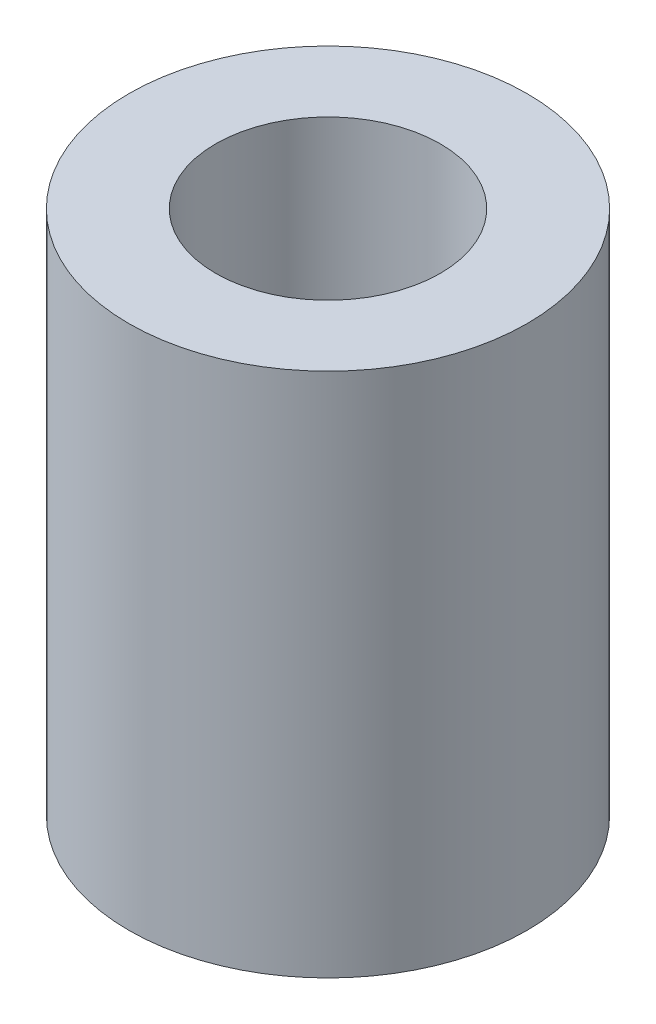
ISO-10303-21;
HEADER;
FILE_DESCRIPTION(('STEP AP214'),'2;1');
FILE_NAME('part.step','',(''),(''),'','','');
FILE_SCHEMA(('AUTOMOTIVE_DESIGN { 1 0 10303 214 1 1 1 1 }'));
ENDSEC;
DATA;
#1=APPLICATION_CONTEXT('core data for automotive mechanical design processes');
#2=APPLICATION_PROTOCOL_DEFINITION('international standard','automotive_design',2000,#1);
#3=PRODUCT_CONTEXT('',#1,'mechanical');
#4=PRODUCT('Part','Part','',(#3));
#5=PRODUCT_RELATED_PRODUCT_CATEGORY('part','',(#4));
#6=PRODUCT_DEFINITION_FORMATION('','',#4);
#7=PRODUCT_DEFINITION_CONTEXT('part definition',#1,'design');
#8=PRODUCT_DEFINITION('design','',#6,#7);
#9=PRODUCT_DEFINITION_SHAPE('','',#8);
#10=(LENGTH_UNIT() NAMED_UNIT(*) SI_UNIT(.MILLI.,.METRE.));
#11=(NAMED_UNIT(*) PLANE_ANGLE_UNIT() SI_UNIT($,.RADIAN.));
#12=(NAMED_UNIT(*) SI_UNIT($,.STERADIAN.) SOLID_ANGLE_UNIT());
#13=UNCERTAINTY_MEASURE_WITH_UNIT(LENGTH_MEASURE(1.E-05),#10,'distance_accuracy_value','');
#14=(GEOMETRIC_REPRESENTATION_CONTEXT(3) GLOBAL_UNCERTAINTY_ASSIGNED_CONTEXT((#13)) GLOBAL_UNIT_ASSIGNED_CONTEXT((#10,
#11,#12)) REPRESENTATION_CONTEXT('',''));
#15=CARTESIAN_POINT('',(0.,0.,0.));
#16=DIRECTION('',(0.,0.,1.));
#17=DIRECTION('',(1.,0.,0.));
#18=AXIS2_PLACEMENT_3D('',#15,#16,#17);
#19=CARTESIAN_POINT('',(0.,13.1938460813418,0.));
#20=DIRECTION('',(0.,-1.,0.));
#21=DIRECTION('',(0.,0.,-1.));
#22=AXIS2_PLACEMENT_3D('',#19,#20,#21);
#23=CYLINDRICAL_SURFACE('',#22,5.);
#24=CARTESIAN_POINT('',(0.,13.1938460813418,0.));
#25=DIRECTION('',(0.,1.,0.));
#26=DIRECTION('',(0.,0.,1.));
#27=AXIS2_PLACEMENT_3D('',#24,#25,#26);
#28=CIRCLE('',#27,5.);
#29=CARTESIAN_POINT('',(0.,13.1938460813418,-5.));
#30=VERTEX_POINT('',#29);
#31=EDGE_CURVE('E10',#30,#30,#28,.T.);
#32=CARTESIAN_POINT('',(0.,0.,0.));
#33=DIRECTION('',(0.,1.,0.));
#34=DIRECTION('',(0.,0.,1.));
#35=AXIS2_PLACEMENT_3D('',#32,#33,#34);
#36=CIRCLE('',#35,5.);
#37=CARTESIAN_POINT('',(0.,0.,-5.));
#38=VERTEX_POINT('',#37);
#39=EDGE_CURVE('E37',#38,#38,#36,.T.);
#40=CARTESIAN_POINT('',(0.,13.1938460813418,-5.));
#41=CARTESIAN_POINT('',(0.,13.0564101846612,-5.));
#42=CARTESIAN_POINT('',(0.,12.9189742879805,-5.));
#43=CARTESIAN_POINT('',(0.,12.6441024946193,-5.));
#44=CARTESIAN_POINT('',(0.,12.5066665979386,-5.));
#45=CARTESIAN_POINT('',(0.,12.2317948045773,-5.));
#46=CARTESIAN_POINT('',(0.,12.0943589078967,-5.));
#47=CARTESIAN_POINT('',(0.,11.8194871145354,-5.));
#48=CARTESIAN_POINT('',(0.,11.6820512178547,-5.));
#49=CARTESIAN_POINT('',(0.,11.4071794244935,-5.));
#50=CARTESIAN_POINT('',(0.,11.2697435278128,-5.));
#51=CARTESIAN_POINT('',(0.,10.9948717344515,-5.));
#52=CARTESIAN_POINT('',(0.,10.8574358377709,-5.));
#53=CARTESIAN_POINT('',(0.,10.5825640444096,-5.));
#54=CARTESIAN_POINT('',(0.,10.4451281477289,-5.));
#55=CARTESIAN_POINT('',(0.,10.1702563543677,-5.));
#56=CARTESIAN_POINT('',(0.,10.032820457687,-5.));
#57=CARTESIAN_POINT('',(0.,9.75794866432573,-5.));
#58=CARTESIAN_POINT('',(0.,9.62051276764509,-5.));
#59=CARTESIAN_POINT('',(0.,9.3456409742838,-5.));
#60=CARTESIAN_POINT('',(0.,9.20820507760315,-5.));
#61=CARTESIAN_POINT('',(0.,8.93333328424186,-5.));
#62=CARTESIAN_POINT('',(0.,8.79589738756122,-5.));
#63=CARTESIAN_POINT('',(0.,8.52102559419993,-5.));
#64=CARTESIAN_POINT('',(0.,8.38358969751929,-5.));
#65=CARTESIAN_POINT('',(0.,8.108717904158,-5.));
#66=CARTESIAN_POINT('',(0.,7.97128200747736,-5.));
#67=CARTESIAN_POINT('',(0.,7.69641021411607,-5.));
#68=CARTESIAN_POINT('',(0.,7.55897431743542,-5.));
#69=CARTESIAN_POINT('',(0.,7.28410252407414,-5.));
#70=CARTESIAN_POINT('',(0.,7.14666662739349,-5.));
#71=CARTESIAN_POINT('',(0.,6.8717948340322,-5.));
#72=CARTESIAN_POINT('',(0.,6.73435893735156,-5.));
#73=CARTESIAN_POINT('',(0.,6.45948714399027,-5.));
#74=CARTESIAN_POINT('',(0.,6.32205124730963,-5.));
#75=CARTESIAN_POINT('',(0.,6.04717945394834,-5.));
#76=CARTESIAN_POINT('',(0.,5.90974355726769,-5.));
#77=CARTESIAN_POINT('',(0.,5.63487176390641,-5.));
#78=CARTESIAN_POINT('',(0.,5.49743586722576,-5.));
#79=CARTESIAN_POINT('',(0.,5.22256407386447,-5.));
#80=CARTESIAN_POINT('',(0.,5.08512817718383,-5.));
#81=CARTESIAN_POINT('',(0.,4.81025638382254,-5.));
#82=CARTESIAN_POINT('',(0.,4.6728204871419,-5.));
#83=CARTESIAN_POINT('',(0.,4.39794869378061,-5.));
#84=CARTESIAN_POINT('',(0.,4.26051279709997,-5.));
#85=CARTESIAN_POINT('',(0.,3.98564100373868,-5.));
#86=CARTESIAN_POINT('',(0.,3.84820510705803,-5.));
#87=CARTESIAN_POINT('',(0.,3.57333331369675,-5.));
#88=CARTESIAN_POINT('',(0.,3.4358974170161,-5.));
#89=CARTESIAN_POINT('',(0.,3.16102562365481,-5.));
#90=CARTESIAN_POINT('',(0.,3.02358972697417,-5.));
#91=CARTESIAN_POINT('',(0.,2.74871793361288,-5.));
#92=CARTESIAN_POINT('',(0.,2.61128203693224,-5.));
#93=CARTESIAN_POINT('',(0.,2.33641024357095,-5.));
#94=CARTESIAN_POINT('',(0.,2.19897434689031,-5.));
#95=CARTESIAN_POINT('',(0.,1.92410255352902,-5.));
#96=CARTESIAN_POINT('',(0.,1.78666665684837,-5.));
#97=CARTESIAN_POINT('',(0.,1.51179486348708,-5.));
#98=CARTESIAN_POINT('',(0.,1.37435896680644,-5.));
#99=CARTESIAN_POINT('',(0.,1.09948717344515,-5.));
#100=CARTESIAN_POINT('',(0.,0.962051276764509,-5.));
#101=CARTESIAN_POINT('',(0.,0.68717948340322,-5.));
#102=CARTESIAN_POINT('',(0.,0.549743586722576,-5.));
#103=CARTESIAN_POINT('',(0.,0.274871793361288,-5.));
#104=CARTESIAN_POINT('',(0.,0.137435896680644,-5.));
#105=CARTESIAN_POINT('',(0.,0.,-5.));
#106=B_SPLINE_CURVE_WITH_KNOTS('',3,(#40,#41,#42,#43,#44,#45,#46,#47,#48,#49,#50,#51,#52,#53,
#54,#55,#56,#57,#58,#59,#60,#61,#62,#63,#64,#65,#66,#67,#68,#69,#70,#71,#72,#73,#74,#75,#76,#77,
#78,#79,#80,#81,#82,#83,#84,#85,#86,#87,#88,#89,#90,#91,#92,#93,#94,#95,#96,#97,#98,#99,#100,
#101,#102,#103,#104,#105),.UNSPECIFIED.,.F.,.F.,(4,2,2,2,2,2,2,2,2,2,2,2,2,2,2,2,2,2,2,2,2,2,2,
2,2,2,2,2,2,2,2,2,4),(0.,0.41230769004193,0.824615380083863,1.23692307012579,1.64923076016773,
2.06153845020966,2.47384614025159,2.88615383029352,3.29846152033546,3.71076921037739,
4.12307690041932,4.53538459046125,4.94769228050318,5.35999997054512,5.77230766058705,
6.18461535062898,6.59692304067091,7.00923073071285,7.42153842075478,7.83384611079671,
8.24615380083864,8.65846149088057,9.07076918092251,9.48307687096444,9.89538456100637,
10.3076922510483,10.7199999410902,11.1323076311322,11.5446153211741,11.956923011216,
12.369230701258,12.7815383912999,13.1938460813418),.UNSPECIFIED.);
#107=EDGE_CURVE('BSEAM40',#30,#38,#106,.T.);
#108=ORIENTED_EDGE('',*,*,#31,.F.);
#109=ORIENTED_EDGE('',*,*,#39,.T.);
#110=ORIENTED_EDGE('',*,*,#107,.T.);
#111=ORIENTED_EDGE('',*,*,#107,.F.);
#112=EDGE_LOOP('',(#108,#110,#109,#111));
#113=FACE_BOUND('',#112,.T.);
#114=ADVANCED_FACE('F40',(#113),#23,.T.);
#115=CARTESIAN_POINT('',(0.,13.1938460813418,0.));
#116=DIRECTION('',(0.,1.,0.));
#117=DIRECTION('',(0.,0.,1.));
#118=AXIS2_PLACEMENT_3D('',#115,#116,#117);
#119=PLANE('',#118);
#120=CARTESIAN_POINT('',(0.,13.1938460813418,0.));
#121=DIRECTION('',(0.,1.,0.));
#122=DIRECTION('',(0.,0.,1.));
#123=AXIS2_PLACEMENT_3D('',#120,#121,#122);
#124=CIRCLE('',#123,2.81906887643416);
#125=CARTESIAN_POINT('',(0.,13.1938460813418,-2.81906887643416));
#126=VERTEX_POINT('',#125);
#127=EDGE_CURVE('E50',#126,#126,#124,.T.);
#128=ORIENTED_EDGE('',*,*,#127,.F.);
#129=EDGE_LOOP('',(#128));
#130=FACE_BOUND('',#129,.T.);
#131=ORIENTED_EDGE('',*,*,#31,.T.);
#132=EDGE_LOOP('',(#131));
#133=FACE_BOUND('',#132,.T.);
#134=ADVANCED_FACE('F59',(#130,#133),#119,.T.);
#135=CARTESIAN_POINT('',(0.,0.,0.));
#136=DIRECTION('',(0.,1.,0.));
#137=DIRECTION('',(0.,0.,1.));
#138=AXIS2_PLACEMENT_3D('',#135,#136,#137);
#139=PLANE('',#138);
#140=CARTESIAN_POINT('',(0.,0.,0.));
#141=DIRECTION('',(0.,1.,0.));
#142=DIRECTION('',(0.,0.,1.));
#143=AXIS2_PLACEMENT_3D('',#140,#141,#142);
#144=CIRCLE('',#143,2.81906887643416);
#145=CARTESIAN_POINT('',(0.,0.,-2.81906887643416));
#146=VERTEX_POINT('',#145);
#147=EDGE_CURVE('E47',#146,#146,#144,.T.);
#148=ORIENTED_EDGE('',*,*,#147,.T.);
#149=EDGE_LOOP('',(#148));
#150=FACE_BOUND('',#149,.T.);
#151=ORIENTED_EDGE('',*,*,#39,.F.);
#152=EDGE_LOOP('',(#151));
#153=FACE_BOUND('',#152,.T.);
#154=ADVANCED_FACE('F58',(#150,#153),#139,.F.);
#155=CARTESIAN_POINT('',(0.,13.1938460813418,0.));
#156=DIRECTION('',(0.,-1.,0.));
#157=DIRECTION('',(0.,0.,-1.));
#158=AXIS2_PLACEMENT_3D('',#155,#156,#157);
#159=CYLINDRICAL_SURFACE('',#158,2.81906887643416);
#160=CARTESIAN_POINT('',(0.,13.1938460813418,-2.81906887643416));
#161=CARTESIAN_POINT('',(0.,13.0564101846612,-2.81906887643416));
#162=CARTESIAN_POINT('',(0.,12.9189742879805,-2.81906887643416));
#163=CARTESIAN_POINT('',(0.,12.6441024946193,-2.81906887643416));
#164=CARTESIAN_POINT('',(0.,12.5066665979386,-2.81906887643416));
#165=CARTESIAN_POINT('',(0.,12.2317948045773,-2.81906887643416));
#166=CARTESIAN_POINT('',(0.,12.0943589078967,-2.81906887643416));
#167=CARTESIAN_POINT('',(0.,11.8194871145354,-2.81906887643416));
#168=CARTESIAN_POINT('',(0.,11.6820512178547,-2.81906887643416));
#169=CARTESIAN_POINT('',(0.,11.4071794244935,-2.81906887643416));
#170=CARTESIAN_POINT('',(0.,11.2697435278128,-2.81906887643416));
#171=CARTESIAN_POINT('',(0.,10.9948717344515,-2.81906887643416));
#172=CARTESIAN_POINT('',(0.,10.8574358377709,-2.81906887643416));
#173=CARTESIAN_POINT('',(0.,10.5825640444096,-2.81906887643416));
#174=CARTESIAN_POINT('',(0.,10.4451281477289,-2.81906887643416));
#175=CARTESIAN_POINT('',(0.,10.1702563543677,-2.81906887643416));
#176=CARTESIAN_POINT('',(0.,10.032820457687,-2.81906887643416));
#177=CARTESIAN_POINT('',(0.,9.75794866432573,-2.81906887643416));
#178=CARTESIAN_POINT('',(0.,9.62051276764509,-2.81906887643416));
#179=CARTESIAN_POINT('',(0.,9.34564097428379,-2.81906887643416));
#180=CARTESIAN_POINT('',(0.,9.20820507760315,-2.81906887643416));
#181=CARTESIAN_POINT('',(0.,8.93333328424186,-2.81906887643416));
#182=CARTESIAN_POINT('',(0.,8.79589738756122,-2.81906887643416));
#183=CARTESIAN_POINT('',(0.,8.52102559419993,-2.81906887643416));
#184=CARTESIAN_POINT('',(0.,8.38358969751929,-2.81906887643416));
#185=CARTESIAN_POINT('',(0.,8.108717904158,-2.81906887643416));
#186=CARTESIAN_POINT('',(0.,7.97128200747736,-2.81906887643416));
#187=CARTESIAN_POINT('',(0.,7.69641021411607,-2.81906887643416));
#188=CARTESIAN_POINT('',(0.,7.55897431743542,-2.81906887643416));
#189=CARTESIAN_POINT('',(0.,7.28410252407413,-2.81906887643416));
#190=CARTESIAN_POINT('',(0.,7.14666662739349,-2.81906887643416));
#191=CARTESIAN_POINT('',(0.,6.8717948340322,-2.81906887643416));
#192=CARTESIAN_POINT('',(0.,6.73435893735156,-2.81906887643416));
#193=CARTESIAN_POINT('',(0.,6.45948714399027,-2.81906887643416));
#194=CARTESIAN_POINT('',(0.,6.32205124730963,-2.81906887643416));
#195=CARTESIAN_POINT('',(0.,6.04717945394834,-2.81906887643416));
#196=CARTESIAN_POINT('',(0.,5.90974355726769,-2.81906887643416));
#197=CARTESIAN_POINT('',(0.,5.63487176390641,-2.81906887643416));
#198=CARTESIAN_POINT('',(0.,5.49743586722576,-2.81906887643416));
#199=CARTESIAN_POINT('',(0.,5.22256407386447,-2.81906887643416));
#200=CARTESIAN_POINT('',(0.,5.08512817718383,-2.81906887643416));
#201=CARTESIAN_POINT('',(0.,4.81025638382254,-2.81906887643416));
#202=CARTESIAN_POINT('',(0.,4.6728204871419,-2.81906887643416));
#203=CARTESIAN_POINT('',(0.,4.39794869378061,-2.81906887643416));
#204=CARTESIAN_POINT('',(0.,4.26051279709997,-2.81906887643416));
#205=CARTESIAN_POINT('',(0.,3.98564100373868,-2.81906887643416));
#206=CARTESIAN_POINT('',(0.,3.84820510705803,-2.81906887643416));
#207=CARTESIAN_POINT('',(0.,3.57333331369675,-2.81906887643416));
#208=CARTESIAN_POINT('',(0.,3.4358974170161,-2.81906887643416));
#209=CARTESIAN_POINT('',(0.,3.16102562365481,-2.81906887643416));
#210=CARTESIAN_POINT('',(0.,3.02358972697417,-2.81906887643416));
#211=CARTESIAN_POINT('',(0.,2.74871793361288,-2.81906887643416));
#212=CARTESIAN_POINT('',(0.,2.61128203693224,-2.81906887643416));
#213=CARTESIAN_POINT('',(0.,2.33641024357095,-2.81906887643416));
#214=CARTESIAN_POINT('',(0.,2.19897434689031,-2.81906887643416));
#215=CARTESIAN_POINT('',(0.,1.92410255352902,-2.81906887643416));
#216=CARTESIAN_POINT('',(0.,1.78666665684837,-2.81906887643416));
#217=CARTESIAN_POINT('',(0.,1.51179486348708,-2.81906887643416));
#218=CARTESIAN_POINT('',(0.,1.37435896680644,-2.81906887643416));
#219=CARTESIAN_POINT('',(0.,1.09948717344515,-2.81906887643416));
#220=CARTESIAN_POINT('',(0.,0.962051276764509,-2.81906887643416));
#221=CARTESIAN_POINT('',(0.,0.68717948340322,-2.81906887643416));
#222=CARTESIAN_POINT('',(0.,0.549743586722576,-2.81906887643416));
#223=CARTESIAN_POINT('',(0.,0.274871793361288,-2.81906887643416));
#224=CARTESIAN_POINT('',(0.,0.137435896680644,-2.81906887643416));
#225=CARTESIAN_POINT('',(0.,0.,-2.81906887643416));
#226=B_SPLINE_CURVE_WITH_KNOTS('',3,(#160,#161,#162,#163,#164,#165,#166,#167,#168,#169,#170,
#171,#172,#173,#174,#175,#176,#177,#178,#179,#180,#181,#182,#183,#184,#185,#186,#187,#188,#189,
#190,#191,#192,#193,#194,#195,#196,#197,#198,#199,#200,#201,#202,#203,#204,#205,#206,#207,#208,
#209,#210,#211,#212,#213,#214,#215,#216,#217,#218,#219,#220,#221,#222,#223,#224,#225),
.UNSPECIFIED.,.F.,.F.,(4,2,2,2,2,2,2,2,2,2,2,2,2,2,2,2,2,2,2,2,2,2,2,2,2,2,2,2,2,2,2,2,4),(0.,
0.412307690041932,0.824615380083864,1.2369230701258,1.64923076016773,2.06153845020966,
2.47384614025159,2.88615383029353,3.29846152033546,3.71076921037739,4.12307690041932,
4.53538459046125,4.94769228050319,5.35999997054512,5.77230766058705,6.18461535062898,
6.59692304067092,7.00923073071285,7.42153842075478,7.83384611079671,8.24615380083864,
8.65846149088057,9.07076918092251,9.48307687096444,9.89538456100637,10.3076922510483,
10.7199999410902,11.1323076311322,11.5446153211741,11.956923011216,12.369230701258,
12.7815383912999,13.1938460813418),.UNSPECIFIED.);
#227=EDGE_CURVE('BSEAM54',#126,#146,#226,.T.);
#228=ORIENTED_EDGE('',*,*,#127,.T.);
#229=ORIENTED_EDGE('',*,*,#147,.F.);
#230=ORIENTED_EDGE('',*,*,#227,.T.);
#231=ORIENTED_EDGE('',*,*,#227,.F.);
#232=EDGE_LOOP('',(#228,#230,#229,#231));
#233=FACE_BOUND('',#232,.T.);
#234=ADVANCED_FACE('F54',(#233),#159,.F.);
#235=CLOSED_SHELL('',(#114,#134,#154,#234));
#236=MANIFOLD_SOLID_BREP('B2',#235);
#237=ADVANCED_BREP_SHAPE_REPRESENTATION('',(#18,#236),#14);
#238=SHAPE_DEFINITION_REPRESENTATION(#9,#237);
ENDSEC;
END-ISO-10303-21;
